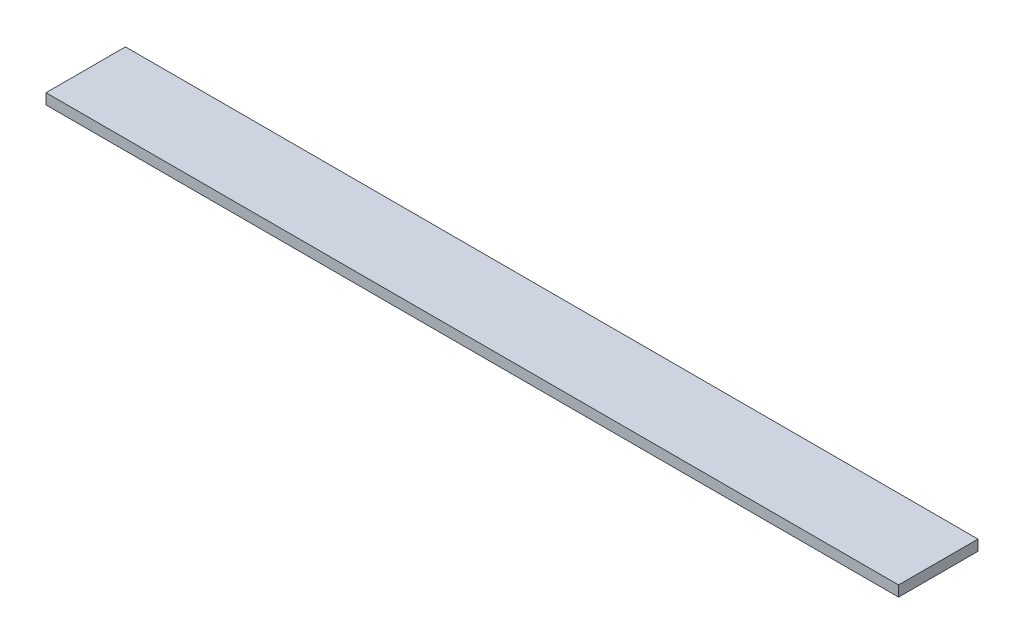
ISO-10303-21;
HEADER;
FILE_DESCRIPTION(('STEP AP214'),'2;1');
FILE_NAME('part.step','',(''),(''),'','','');
FILE_SCHEMA(('AUTOMOTIVE_DESIGN { 1 0 10303 214 1 1 1 1 }'));
ENDSEC;
DATA;
#1=APPLICATION_CONTEXT('core data for automotive mechanical design processes');
#2=APPLICATION_PROTOCOL_DEFINITION('international standard','automotive_design',2000,#1);
#3=PRODUCT_CONTEXT('',#1,'mechanical');
#4=PRODUCT('Part','Part','',(#3));
#5=PRODUCT_RELATED_PRODUCT_CATEGORY('part','',(#4));
#6=PRODUCT_DEFINITION_FORMATION('','',#4);
#7=PRODUCT_DEFINITION_CONTEXT('part definition',#1,'design');
#8=PRODUCT_DEFINITION('design','',#6,#7);
#9=PRODUCT_DEFINITION_SHAPE('','',#8);
#10=(LENGTH_UNIT() NAMED_UNIT(*) SI_UNIT(.MILLI.,.METRE.));
#11=(NAMED_UNIT(*) PLANE_ANGLE_UNIT() SI_UNIT($,.RADIAN.));
#12=(NAMED_UNIT(*) SI_UNIT($,.STERADIAN.) SOLID_ANGLE_UNIT());
#13=UNCERTAINTY_MEASURE_WITH_UNIT(LENGTH_MEASURE(1.E-05),#10,'distance_accuracy_value','');
#14=(GEOMETRIC_REPRESENTATION_CONTEXT(3) GLOBAL_UNCERTAINTY_ASSIGNED_CONTEXT((#13)) GLOBAL_UNIT_ASSIGNED_CONTEXT((#10,
#11,#12)) REPRESENTATION_CONTEXT('',''));
#15=CARTESIAN_POINT('',(0.,0.,0.));
#16=DIRECTION('',(0.,0.,1.));
#17=DIRECTION('',(1.,0.,0.));
#18=AXIS2_PLACEMENT_3D('',#15,#16,#17);
#19=CARTESIAN_POINT('',(322.,-2.,-15.));
#20=DIRECTION('',(0.,0.,1.));
#21=DIRECTION('',(1.,0.,0.));
#22=AXIS2_PLACEMENT_3D('',#19,#20,#21);
#23=PLANE('',#22);
#24=DIRECTION('',(0.,1.,0.));
#25=VECTOR('',#24,1.);
#26=CARTESIAN_POINT('',(0.,-2.,-15.));
#27=LINE('',#26,#25);
#28=CARTESIAN_POINT('',(0.,-2.,-15.));
#29=VERTEX_POINT('',#28);
#30=CARTESIAN_POINT('',(0.,2.,-15.));
#31=VERTEX_POINT('',#30);
#32=EDGE_CURVE('E98',#29,#31,#27,.T.);
#33=ORIENTED_EDGE('',*,*,#32,.T.);
#34=DIRECTION('',(-1.,0.,0.));
#35=VECTOR('',#34,1.);
#36=CARTESIAN_POINT('',(322.,2.,-15.));
#37=LINE('',#36,#35);
#38=CARTESIAN_POINT('',(322.,2.,-15.));
#39=VERTEX_POINT('',#38);
#40=EDGE_CURVE('E11',#39,#31,#37,.T.);
#41=ORIENTED_EDGE('',*,*,#40,.F.);
#42=DIRECTION('',(0.,1.,0.));
#43=VECTOR('',#42,1.);
#44=CARTESIAN_POINT('',(322.,-2.,-15.));
#45=LINE('',#44,#43);
#46=CARTESIAN_POINT('',(322.,-2.,-15.));
#47=VERTEX_POINT('',#46);
#48=EDGE_CURVE('E86',#47,#39,#45,.T.);
#49=ORIENTED_EDGE('',*,*,#48,.F.);
#50=DIRECTION('',(-1.,0.,0.));
#51=VECTOR('',#50,1.);
#52=CARTESIAN_POINT('',(322.,-2.,-15.));
#53=LINE('',#52,#51);
#54=EDGE_CURVE('E94',#47,#29,#53,.T.);
#55=ORIENTED_EDGE('',*,*,#54,.T.);
#56=EDGE_LOOP('',(#33,#41,#49,#55));
#57=FACE_BOUND('',#56,.T.);
#58=ADVANCED_FACE('F35',(#57),#23,.F.);
#59=CARTESIAN_POINT('',(322.,2.,15.));
#60=DIRECTION('',(0.,-1.,0.));
#61=DIRECTION('',(0.,0.,-1.));
#62=AXIS2_PLACEMENT_3D('',#59,#60,#61);
#63=PLANE('',#62);
#64=DIRECTION('',(0.,0.,1.));
#65=VECTOR('',#64,1.);
#66=CARTESIAN_POINT('',(0.,2.,15.));
#67=LINE('',#66,#65);
#68=CARTESIAN_POINT('',(0.,2.,15.));
#69=VERTEX_POINT('',#68);
#70=EDGE_CURVE('E90',#31,#69,#67,.T.);
#71=ORIENTED_EDGE('',*,*,#70,.T.);
#72=DIRECTION('',(-1.,0.,0.));
#73=VECTOR('',#72,1.);
#74=CARTESIAN_POINT('',(322.,2.,15.));
#75=LINE('',#74,#73);
#76=CARTESIAN_POINT('',(322.,2.,15.));
#77=VERTEX_POINT('',#76);
#78=EDGE_CURVE('E43',#77,#69,#75,.T.);
#79=ORIENTED_EDGE('',*,*,#78,.F.);
#80=DIRECTION('',(0.,0.,1.));
#81=VECTOR('',#80,1.);
#82=CARTESIAN_POINT('',(322.,2.,15.));
#83=LINE('',#82,#81);
#84=EDGE_CURVE('E81',#39,#77,#83,.T.);
#85=ORIENTED_EDGE('',*,*,#84,.F.);
#86=ORIENTED_EDGE('',*,*,#40,.T.);
#87=EDGE_LOOP('',(#71,#79,#85,#86));
#88=FACE_BOUND('',#87,.T.);
#89=ADVANCED_FACE('F89',(#88),#63,.F.);
#90=CARTESIAN_POINT('',(322.,-2.,15.));
#91=DIRECTION('',(0.,0.,-1.));
#92=DIRECTION('',(-1.,0.,0.));
#93=AXIS2_PLACEMENT_3D('',#90,#91,#92);
#94=PLANE('',#93);
#95=DIRECTION('',(0.,-1.,0.));
#96=VECTOR('',#95,1.);
#97=CARTESIAN_POINT('',(0.,-2.,15.));
#98=LINE('',#97,#96);
#99=CARTESIAN_POINT('',(0.,-2.,15.));
#100=VERTEX_POINT('',#99);
#101=EDGE_CURVE('E68',#69,#100,#98,.T.);
#102=ORIENTED_EDGE('',*,*,#101,.T.);
#103=DIRECTION('',(-1.,0.,0.));
#104=VECTOR('',#103,1.);
#105=CARTESIAN_POINT('',(322.,-2.,15.));
#106=LINE('',#105,#104);
#107=CARTESIAN_POINT('',(322.,-2.,15.));
#108=VERTEX_POINT('',#107);
#109=EDGE_CURVE('E91',#108,#100,#106,.T.);
#110=ORIENTED_EDGE('',*,*,#109,.F.);
#111=DIRECTION('',(0.,-1.,0.));
#112=VECTOR('',#111,1.);
#113=CARTESIAN_POINT('',(322.,-2.,15.));
#114=LINE('',#113,#112);
#115=EDGE_CURVE('E84',#77,#108,#114,.T.);
#116=ORIENTED_EDGE('',*,*,#115,.F.);
#117=ORIENTED_EDGE('',*,*,#78,.T.);
#118=EDGE_LOOP('',(#102,#110,#116,#117));
#119=FACE_BOUND('',#118,.T.);
#120=ADVANCED_FACE('F92',(#119),#94,.F.);
#121=CARTESIAN_POINT('',(322.,-2.,15.));
#122=DIRECTION('',(0.,1.,0.));
#123=DIRECTION('',(0.,0.,1.));
#124=AXIS2_PLACEMENT_3D('',#121,#122,#123);
#125=PLANE('',#124);
#126=DIRECTION('',(0.,0.,-1.));
#127=VECTOR('',#126,1.);
#128=CARTESIAN_POINT('',(0.,-2.,15.));
#129=LINE('',#128,#127);
#130=EDGE_CURVE('E74',#100,#29,#129,.T.);
#131=ORIENTED_EDGE('',*,*,#130,.T.);
#132=ORIENTED_EDGE('',*,*,#54,.F.);
#133=DIRECTION('',(0.,0.,-1.));
#134=VECTOR('',#133,1.);
#135=CARTESIAN_POINT('',(322.,-2.,15.));
#136=LINE('',#135,#134);
#137=EDGE_CURVE('E51',#108,#47,#136,.T.);
#138=ORIENTED_EDGE('',*,*,#137,.F.);
#139=ORIENTED_EDGE('',*,*,#109,.T.);
#140=EDGE_LOOP('',(#131,#132,#138,#139));
#141=FACE_BOUND('',#140,.T.);
#142=ADVANCED_FACE('F105',(#141),#125,.F.);
#143=CARTESIAN_POINT('',(322.,0.,0.));
#144=DIRECTION('',(-1.,0.,0.));
#145=DIRECTION('',(0.,0.,1.));
#146=AXIS2_PLACEMENT_3D('',#143,#144,#145);
#147=PLANE('',#146);
#148=ORIENTED_EDGE('',*,*,#48,.T.);
#149=ORIENTED_EDGE('',*,*,#84,.T.);
#150=ORIENTED_EDGE('',*,*,#115,.T.);
#151=ORIENTED_EDGE('',*,*,#137,.T.);
#152=EDGE_LOOP('',(#148,#149,#150,#151));
#153=FACE_BOUND('',#152,.T.);
#154=ADVANCED_FACE('F82',(#153),#147,.F.);
#155=CARTESIAN_POINT('',(0.,0.,0.));
#156=DIRECTION('',(-1.,0.,0.));
#157=DIRECTION('',(0.,0.,1.));
#158=AXIS2_PLACEMENT_3D('',#155,#156,#157);
#159=PLANE('',#158);
#160=ORIENTED_EDGE('',*,*,#32,.F.);
#161=ORIENTED_EDGE('',*,*,#130,.F.);
#162=ORIENTED_EDGE('',*,*,#101,.F.);
#163=ORIENTED_EDGE('',*,*,#70,.F.);
#164=EDGE_LOOP('',(#160,#161,#162,#163));
#165=FACE_BOUND('',#164,.T.);
#166=ADVANCED_FACE('F108',(#165),#159,.T.);
#167=CLOSED_SHELL('',(#58,#89,#120,#142,#154,#166));
#168=MANIFOLD_SOLID_BREP('B2',#167);
#169=ADVANCED_BREP_SHAPE_REPRESENTATION('',(#18,#168),#14);
#170=SHAPE_DEFINITION_REPRESENTATION(#9,#169);
ENDSEC;
END-ISO-10303-21;
